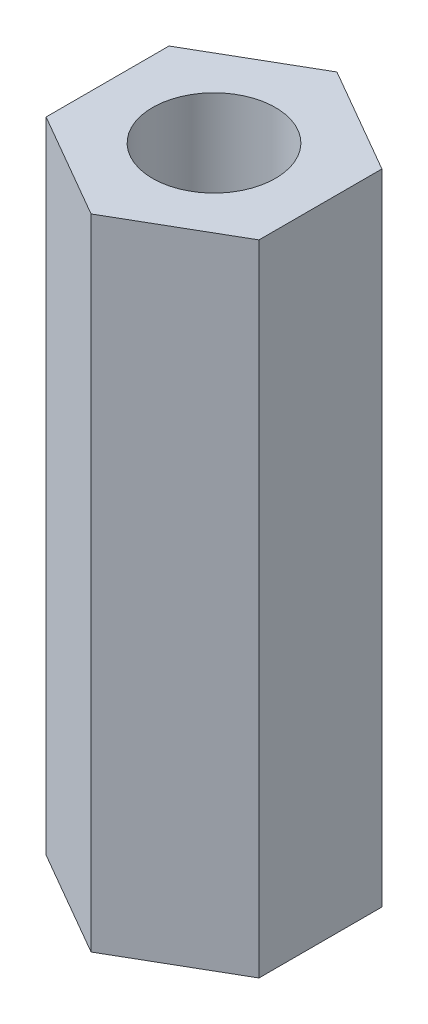
ISO-10303-21;
HEADER;
FILE_DESCRIPTION(('STEP AP214'),'2;1');
FILE_NAME('part.step','',(''),(''),'','','');
FILE_SCHEMA(('AUTOMOTIVE_DESIGN { 1 0 10303 214 1 1 1 1 }'));
ENDSEC;
DATA;
#1=APPLICATION_CONTEXT('core data for automotive mechanical design processes');
#2=APPLICATION_PROTOCOL_DEFINITION('international standard','automotive_design',2000,#1);
#3=PRODUCT_CONTEXT('',#1,'mechanical');
#4=PRODUCT('Part','Part','',(#3));
#5=PRODUCT_RELATED_PRODUCT_CATEGORY('part','',(#4));
#6=PRODUCT_DEFINITION_FORMATION('','',#4);
#7=PRODUCT_DEFINITION_CONTEXT('part definition',#1,'design');
#8=PRODUCT_DEFINITION('design','',#6,#7);
#9=PRODUCT_DEFINITION_SHAPE('','',#8);
#10=(LENGTH_UNIT() NAMED_UNIT(*) SI_UNIT(.MILLI.,.METRE.));
#11=(NAMED_UNIT(*) PLANE_ANGLE_UNIT() SI_UNIT($,.RADIAN.));
#12=(NAMED_UNIT(*) SI_UNIT($,.STERADIAN.) SOLID_ANGLE_UNIT());
#13=UNCERTAINTY_MEASURE_WITH_UNIT(LENGTH_MEASURE(1.E-05),#10,'distance_accuracy_value','');
#14=(GEOMETRIC_REPRESENTATION_CONTEXT(3) GLOBAL_UNCERTAINTY_ASSIGNED_CONTEXT((#13)) GLOBAL_UNIT_ASSIGNED_CONTEXT((#10,
#11,#12)) REPRESENTATION_CONTEXT('',''));
#15=CARTESIAN_POINT('',(0.,0.,0.));
#16=DIRECTION('',(0.,0.,1.));
#17=DIRECTION('',(1.,0.,0.));
#18=AXIS2_PLACEMENT_3D('',#15,#16,#17);
#19=CARTESIAN_POINT('',(0.,26.,-5.));
#20=DIRECTION('',(0.,1.,0.));
#21=DIRECTION('',(0.,0.,1.));
#22=AXIS2_PLACEMENT_3D('',#19,#20,#21);
#23=PLANE('',#22);
#24=DIRECTION('',(-0.866025403784439,0.,-0.5));
#25=VECTOR('',#24,1.);
#26=CARTESIAN_POINT('',(4.33012701892219,26.,-2.5));
#27=LINE('',#26,#25);
#28=CARTESIAN_POINT('',(4.33012701892219,26.,-2.5));
#29=VERTEX_POINT('',#28);
#30=CARTESIAN_POINT('',(0.,26.,-5.));
#31=VERTEX_POINT('',#30);
#32=EDGE_CURVE('E127',#29,#31,#27,.T.);
#33=ORIENTED_EDGE('',*,*,#32,.T.);
#34=DIRECTION('',(-0.866025403784439,0.,0.5));
#35=VECTOR('',#34,1.);
#36=CARTESIAN_POINT('',(0.,26.,-5.));
#37=LINE('',#36,#35);
#38=CARTESIAN_POINT('',(-4.33012701892219,26.,-2.5));
#39=VERTEX_POINT('',#38);
#40=EDGE_CURVE('E85',#31,#39,#37,.T.);
#41=ORIENTED_EDGE('',*,*,#40,.T.);
#42=DIRECTION('',(0.,0.,1.));
#43=VECTOR('',#42,1.);
#44=CARTESIAN_POINT('',(-4.33012701892219,26.,-2.5));
#45=LINE('',#44,#43);
#46=CARTESIAN_POINT('',(-4.33012701892219,26.,2.5));
#47=VERTEX_POINT('',#46);
#48=EDGE_CURVE('E98',#39,#47,#45,.T.);
#49=ORIENTED_EDGE('',*,*,#48,.T.);
#50=DIRECTION('',(0.866025403784439,0.,0.5));
#51=VECTOR('',#50,1.);
#52=CARTESIAN_POINT('',(-4.33012701892219,26.,2.5));
#53=LINE('',#52,#51);
#54=CARTESIAN_POINT('',(0.,26.,5.));
#55=VERTEX_POINT('',#54);
#56=EDGE_CURVE('E92',#47,#55,#53,.T.);
#57=ORIENTED_EDGE('',*,*,#56,.T.);
#58=DIRECTION('',(0.866025403784439,0.,-0.5));
#59=VECTOR('',#58,1.);
#60=CARTESIAN_POINT('',(0.,26.,5.));
#61=LINE('',#60,#59);
#62=CARTESIAN_POINT('',(4.33012701892219,26.,2.5));
#63=VERTEX_POINT('',#62);
#64=EDGE_CURVE('E96',#55,#63,#61,.T.);
#65=ORIENTED_EDGE('',*,*,#64,.T.);
#66=DIRECTION('',(0.,0.,-1.));
#67=VECTOR('',#66,1.);
#68=CARTESIAN_POINT('',(4.33012701892219,26.,2.5));
#69=LINE('',#68,#67);
#70=EDGE_CURVE('E48',#63,#29,#69,.T.);
#71=ORIENTED_EDGE('',*,*,#70,.T.);
#72=EDGE_LOOP('',(#33,#41,#49,#57,#65,#71));
#73=FACE_BOUND('',#72,.T.);
#74=CARTESIAN_POINT('',(0.,26.,0.));
#75=DIRECTION('',(0.,1.,0.));
#76=DIRECTION('',(0.,0.,1.));
#77=AXIS2_PLACEMENT_3D('',#74,#75,#76);
#78=CIRCLE('',#77,2.5);
#79=CARTESIAN_POINT('',(0.,26.,2.5));
#80=VERTEX_POINT('',#79);
#81=EDGE_CURVE('E120',#80,#80,#78,.T.);
#82=ORIENTED_EDGE('',*,*,#81,.F.);
#83=EDGE_LOOP('',(#82));
#84=FACE_BOUND('',#83,.T.);
#85=ADVANCED_FACE('F31',(#73,#84),#23,.T.);
#86=CARTESIAN_POINT('',(0.,0.,-5.));
#87=DIRECTION('',(0.,1.,0.));
#88=DIRECTION('',(0.,0.,1.));
#89=AXIS2_PLACEMENT_3D('',#86,#87,#88);
#90=PLANE('',#89);
#91=DIRECTION('',(-0.866025403784439,0.,-0.5));
#92=VECTOR('',#91,1.);
#93=CARTESIAN_POINT('',(4.33012701892219,0.,-2.5));
#94=LINE('',#93,#92);
#95=CARTESIAN_POINT('',(4.33012701892219,0.,-2.5));
#96=VERTEX_POINT('',#95);
#97=CARTESIAN_POINT('',(0.,0.,-5.));
#98=VERTEX_POINT('',#97);
#99=EDGE_CURVE('E116',#96,#98,#94,.T.);
#100=ORIENTED_EDGE('',*,*,#99,.F.);
#101=DIRECTION('',(0.,0.,-1.));
#102=VECTOR('',#101,1.);
#103=CARTESIAN_POINT('',(4.33012701892219,0.,2.5));
#104=LINE('',#103,#102);
#105=CARTESIAN_POINT('',(4.33012701892219,0.,2.5));
#106=VERTEX_POINT('',#105);
#107=EDGE_CURVE('E77',#106,#96,#104,.T.);
#108=ORIENTED_EDGE('',*,*,#107,.F.);
#109=DIRECTION('',(0.866025403784439,0.,-0.5));
#110=VECTOR('',#109,1.);
#111=CARTESIAN_POINT('',(0.,0.,5.));
#112=LINE('',#111,#110);
#113=CARTESIAN_POINT('',(0.,0.,5.));
#114=VERTEX_POINT('',#113);
#115=EDGE_CURVE('E71',#114,#106,#112,.T.);
#116=ORIENTED_EDGE('',*,*,#115,.F.);
#117=DIRECTION('',(0.866025403784439,0.,0.5));
#118=VECTOR('',#117,1.);
#119=CARTESIAN_POINT('',(-4.33012701892219,0.,2.5));
#120=LINE('',#119,#118);
#121=CARTESIAN_POINT('',(-4.33012701892219,0.,2.5));
#122=VERTEX_POINT('',#121);
#123=EDGE_CURVE('E106',#122,#114,#120,.T.);
#124=ORIENTED_EDGE('',*,*,#123,.F.);
#125=DIRECTION('',(0.,0.,1.));
#126=VECTOR('',#125,1.);
#127=CARTESIAN_POINT('',(-4.33012701892219,0.,-2.5));
#128=LINE('',#127,#126);
#129=CARTESIAN_POINT('',(-4.33012701892219,0.,-2.5));
#130=VERTEX_POINT('',#129);
#131=EDGE_CURVE('E122',#130,#122,#128,.T.);
#132=ORIENTED_EDGE('',*,*,#131,.F.);
#133=DIRECTION('',(-0.866025403784439,0.,0.5));
#134=VECTOR('',#133,1.);
#135=CARTESIAN_POINT('',(0.,0.,-5.));
#136=LINE('',#135,#134);
#137=EDGE_CURVE('E119',#98,#130,#136,.T.);
#138=ORIENTED_EDGE('',*,*,#137,.F.);
#139=EDGE_LOOP('',(#100,#108,#116,#124,#132,#138));
#140=FACE_BOUND('',#139,.T.);
#141=CARTESIAN_POINT('',(0.,0.,0.));
#142=DIRECTION('',(0.,1.,0.));
#143=DIRECTION('',(0.,0.,1.));
#144=AXIS2_PLACEMENT_3D('',#141,#142,#143);
#145=CIRCLE('',#144,2.5);
#146=CARTESIAN_POINT('',(0.,0.,2.5));
#147=VERTEX_POINT('',#146);
#148=EDGE_CURVE('E220',#147,#147,#145,.T.);
#149=ORIENTED_EDGE('',*,*,#148,.T.);
#150=EDGE_LOOP('',(#149));
#151=FACE_BOUND('',#150,.T.);
#152=ADVANCED_FACE('F136',(#140,#151),#90,.F.);
#153=CARTESIAN_POINT('',(4.33012701892219,26.,-2.5));
#154=DIRECTION('',(-0.5,0.,0.866025403784439));
#155=DIRECTION('',(0.866025403784439,0.,0.5));
#156=AXIS2_PLACEMENT_3D('',#153,#154,#155);
#157=PLANE('',#156);
#158=ORIENTED_EDGE('',*,*,#99,.T.);
#159=DIRECTION('',(0.,-1.,0.));
#160=VECTOR('',#159,1.);
#161=CARTESIAN_POINT('',(0.,26.,-5.));
#162=LINE('',#161,#160);
#163=EDGE_CURVE('E11',#31,#98,#162,.T.);
#164=ORIENTED_EDGE('',*,*,#163,.F.);
#165=ORIENTED_EDGE('',*,*,#32,.F.);
#166=DIRECTION('',(0.,-1.,0.));
#167=VECTOR('',#166,1.);
#168=CARTESIAN_POINT('',(4.33012701892219,26.,-2.5));
#169=LINE('',#168,#167);
#170=EDGE_CURVE('E112',#29,#96,#169,.T.);
#171=ORIENTED_EDGE('',*,*,#170,.T.);
#172=EDGE_LOOP('',(#158,#164,#165,#171));
#173=FACE_BOUND('',#172,.T.);
#174=ADVANCED_FACE('F33',(#173),#157,.F.);
#175=CARTESIAN_POINT('',(0.,26.,-5.));
#176=DIRECTION('',(0.5,0.,0.866025403784439));
#177=DIRECTION('',(0.866025403784439,0.,-0.5));
#178=AXIS2_PLACEMENT_3D('',#175,#176,#177);
#179=PLANE('',#178);
#180=ORIENTED_EDGE('',*,*,#137,.T.);
#181=DIRECTION('',(0.,-1.,0.));
#182=VECTOR('',#181,1.);
#183=CARTESIAN_POINT('',(-4.33012701892219,26.,-2.5));
#184=LINE('',#183,#182);
#185=EDGE_CURVE('E40',#39,#130,#184,.T.);
#186=ORIENTED_EDGE('',*,*,#185,.F.);
#187=ORIENTED_EDGE('',*,*,#40,.F.);
#188=ORIENTED_EDGE('',*,*,#163,.T.);
#189=EDGE_LOOP('',(#180,#186,#187,#188));
#190=FACE_BOUND('',#189,.T.);
#191=ADVANCED_FACE('F161',(#190),#179,.F.);
#192=CARTESIAN_POINT('',(-4.33012701892219,26.,-2.5));
#193=DIRECTION('',(1.,0.,0.));
#194=DIRECTION('',(0.,0.,-1.));
#195=AXIS2_PLACEMENT_3D('',#192,#193,#194);
#196=PLANE('',#195);
#197=ORIENTED_EDGE('',*,*,#131,.T.);
#198=DIRECTION('',(0.,-1.,0.));
#199=VECTOR('',#198,1.);
#200=CARTESIAN_POINT('',(-4.33012701892219,26.,2.5));
#201=LINE('',#200,#199);
#202=EDGE_CURVE('E107',#47,#122,#201,.T.);
#203=ORIENTED_EDGE('',*,*,#202,.F.);
#204=ORIENTED_EDGE('',*,*,#48,.F.);
#205=ORIENTED_EDGE('',*,*,#185,.T.);
#206=EDGE_LOOP('',(#197,#203,#204,#205));
#207=FACE_BOUND('',#206,.T.);
#208=ADVANCED_FACE('F133',(#207),#196,.F.);
#209=CARTESIAN_POINT('',(-4.33012701892219,26.,2.5));
#210=DIRECTION('',(0.5,0.,-0.866025403784439));
#211=DIRECTION('',(-0.866025403784439,0.,-0.5));
#212=AXIS2_PLACEMENT_3D('',#209,#210,#211);
#213=PLANE('',#212);
#214=ORIENTED_EDGE('',*,*,#123,.T.);
#215=DIRECTION('',(0.,-1.,0.));
#216=VECTOR('',#215,1.);
#217=CARTESIAN_POINT('',(0.,26.,5.));
#218=LINE('',#217,#216);
#219=EDGE_CURVE('E103',#55,#114,#218,.T.);
#220=ORIENTED_EDGE('',*,*,#219,.F.);
#221=ORIENTED_EDGE('',*,*,#56,.F.);
#222=ORIENTED_EDGE('',*,*,#202,.T.);
#223=EDGE_LOOP('',(#214,#220,#221,#222));
#224=FACE_BOUND('',#223,.T.);
#225=ADVANCED_FACE('F104',(#224),#213,.F.);
#226=CARTESIAN_POINT('',(0.,26.,5.));
#227=DIRECTION('',(-0.5,0.,-0.866025403784439));
#228=DIRECTION('',(-0.866025403784439,0.,0.5));
#229=AXIS2_PLACEMENT_3D('',#226,#227,#228);
#230=PLANE('',#229);
#231=ORIENTED_EDGE('',*,*,#115,.T.);
#232=DIRECTION('',(0.,-1.,0.));
#233=VECTOR('',#232,1.);
#234=CARTESIAN_POINT('',(4.33012701892219,26.,2.5));
#235=LINE('',#234,#233);
#236=EDGE_CURVE('E108',#63,#106,#235,.T.);
#237=ORIENTED_EDGE('',*,*,#236,.F.);
#238=ORIENTED_EDGE('',*,*,#64,.F.);
#239=ORIENTED_EDGE('',*,*,#219,.T.);
#240=EDGE_LOOP('',(#231,#237,#238,#239));
#241=FACE_BOUND('',#240,.T.);
#242=ADVANCED_FACE('F110',(#241),#230,.F.);
#243=CARTESIAN_POINT('',(4.33012701892219,26.,2.5));
#244=DIRECTION('',(-1.,0.,0.));
#245=DIRECTION('',(0.,0.,1.));
#246=AXIS2_PLACEMENT_3D('',#243,#244,#245);
#247=PLANE('',#246);
#248=ORIENTED_EDGE('',*,*,#107,.T.);
#249=ORIENTED_EDGE('',*,*,#170,.F.);
#250=ORIENTED_EDGE('',*,*,#70,.F.);
#251=ORIENTED_EDGE('',*,*,#236,.T.);
#252=EDGE_LOOP('',(#248,#249,#250,#251));
#253=FACE_BOUND('',#252,.T.);
#254=ADVANCED_FACE('F141',(#253),#247,.F.);
#255=CARTESIAN_POINT('',(0.,26.,0.));
#256=DIRECTION('',(0.,-1.,0.));
#257=DIRECTION('',(0.,0.,-1.));
#258=AXIS2_PLACEMENT_3D('',#255,#256,#257);
#259=CYLINDRICAL_SURFACE('',#258,2.5);
#260=ORIENTED_EDGE('',*,*,#81,.T.);
#261=EDGE_LOOP('',(#260));
#262=FACE_BOUND('',#261,.T.);
#263=ORIENTED_EDGE('',*,*,#148,.F.);
#264=EDGE_LOOP('',(#263));
#265=FACE_BOUND('',#264,.T.);
#266=ADVANCED_FACE('F143',(#262,#265),#259,.F.);
#267=CLOSED_SHELL('',(#85,#152,#174,#191,#208,#225,#242,#254,#266));
#268=MANIFOLD_SOLID_BREP('B2',#267);
#269=ADVANCED_BREP_SHAPE_REPRESENTATION('',(#18,#268),#14);
#270=SHAPE_DEFINITION_REPRESENTATION(#9,#269);
ENDSEC;
END-ISO-10303-21;
